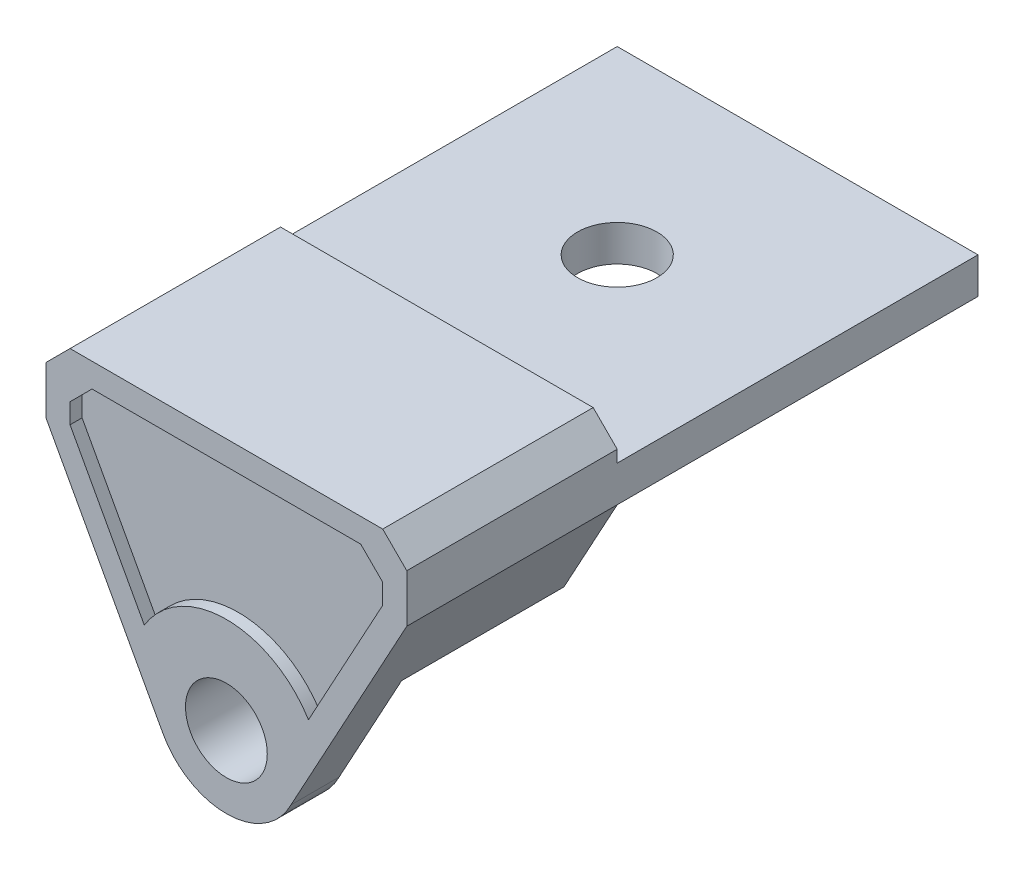
ISO-10303-21;
HEADER;
FILE_DESCRIPTION(('STEP AP214'),'2;1');
FILE_NAME('part.step','',(''),(''),'','','');
FILE_SCHEMA(('AUTOMOTIVE_DESIGN { 1 0 10303 214 1 1 1 1 }'));
ENDSEC;
DATA;
#1=APPLICATION_CONTEXT('core data for automotive mechanical design processes');
#2=APPLICATION_PROTOCOL_DEFINITION('international standard','automotive_design',2000,#1);
#3=PRODUCT_CONTEXT('',#1,'mechanical');
#4=PRODUCT('Part','Part','',(#3));
#5=PRODUCT_RELATED_PRODUCT_CATEGORY('part','',(#4));
#6=PRODUCT_DEFINITION_FORMATION('','',#4);
#7=PRODUCT_DEFINITION_CONTEXT('part definition',#1,'design');
#8=PRODUCT_DEFINITION('design','',#6,#7);
#9=PRODUCT_DEFINITION_SHAPE('','',#8);
#10=(LENGTH_UNIT() NAMED_UNIT(*) SI_UNIT(.MILLI.,.METRE.));
#11=(NAMED_UNIT(*) PLANE_ANGLE_UNIT() SI_UNIT($,.RADIAN.));
#12=(NAMED_UNIT(*) SI_UNIT($,.STERADIAN.) SOLID_ANGLE_UNIT());
#13=UNCERTAINTY_MEASURE_WITH_UNIT(LENGTH_MEASURE(1.E-05),#10,'distance_accuracy_value','');
#14=(GEOMETRIC_REPRESENTATION_CONTEXT(3) GLOBAL_UNCERTAINTY_ASSIGNED_CONTEXT((#13)) GLOBAL_UNIT_ASSIGNED_CONTEXT((#10,
#11,#12)) REPRESENTATION_CONTEXT('',''));
#15=CARTESIAN_POINT('',(0.,0.,0.));
#16=DIRECTION('',(0.,0.,1.));
#17=DIRECTION('',(1.,0.,0.));
#18=AXIS2_PLACEMENT_3D('',#15,#16,#17);
#19=CARTESIAN_POINT('',(0.,10.5,-14.4186473205535));
#20=DIRECTION('',(0.,-1.,0.));
#21=DIRECTION('',(1.,0.,0.));
#22=AXIS2_PLACEMENT_3D('',#19,#20,#21);
#23=PLANE('',#22);
#24=DIRECTION('',(-1.,0.,0.));
#25=VECTOR('',#24,1.);
#26=CARTESIAN_POINT('',(7.5,10.5,-2.));
#27=LINE('',#26,#25);
#28=CARTESIAN_POINT('',(6.50000000000001,10.5,-2.));
#29=VERTEX_POINT('',#28);
#30=CARTESIAN_POINT('',(-6.5,10.5,-2.));
#31=VERTEX_POINT('',#30);
#32=EDGE_CURVE('E295',#29,#31,#27,.T.);
#33=ORIENTED_EDGE('',*,*,#32,.T.);
#34=DIRECTION('',(0.,0.,1.));
#35=VECTOR('',#34,1.);
#36=CARTESIAN_POINT('',(-6.5,10.5,6.75));
#37=LINE('',#36,#35);
#38=CARTESIAN_POINT('',(-6.5,10.5,6.75));
#39=VERTEX_POINT('',#38);
#40=EDGE_CURVE('E280',#31,#39,#37,.T.);
#41=ORIENTED_EDGE('',*,*,#40,.T.);
#42=DIRECTION('',(1.,0.,0.));
#43=VECTOR('',#42,1.);
#44=CARTESIAN_POINT('',(0.,10.5,6.75));
#45=LINE('',#44,#43);
#46=CARTESIAN_POINT('',(6.50000000000001,10.5,6.75));
#47=VERTEX_POINT('',#46);
#48=EDGE_CURVE('E236',#39,#47,#45,.T.);
#49=ORIENTED_EDGE('',*,*,#48,.T.);
#50=DIRECTION('',(0.,0.,-1.));
#51=VECTOR('',#50,1.);
#52=CARTESIAN_POINT('',(6.50000000000001,10.5,-14.4186473205535));
#53=LINE('',#52,#51);
#54=EDGE_CURVE('E277',#47,#29,#53,.T.);
#55=ORIENTED_EDGE('',*,*,#54,.T.);
#56=EDGE_LOOP('',(#33,#41,#49,#55));
#57=FACE_BOUND('',#56,.T.);
#58=ADVANCED_FACE('F36',(#57),#23,.F.);
#59=CARTESIAN_POINT('',(0.,0.,6.75));
#60=DIRECTION('',(0.,0.,1.));
#61=DIRECTION('',(1.,0.,0.));
#62=AXIS2_PLACEMENT_3D('',#59,#60,#61);
#63=PLANE('',#62);
#64=ORIENTED_EDGE('',*,*,#48,.F.);
#65=DIRECTION('',(-0.707106781186549,-0.707106781186546,0.));
#66=VECTOR('',#65,1.);
#67=CARTESIAN_POINT('',(-8.49999999999998,8.50000000000002,6.75));
#68=LINE('',#67,#66);
#69=CARTESIAN_POINT('',(-7.5,9.5,6.75));
#70=VERTEX_POINT('',#69);
#71=EDGE_CURVE('E44',#39,#70,#68,.T.);
#72=ORIENTED_EDGE('',*,*,#71,.T.);
#73=DIRECTION('',(0.,-1.,0.));
#74=VECTOR('',#73,1.);
#75=CARTESIAN_POINT('',(-7.5,0.,6.75));
#76=LINE('',#75,#74);
#77=CARTESIAN_POINT('',(-7.5,7.5,6.75));
#78=VERTEX_POINT('',#77);
#79=EDGE_CURVE('E238',#70,#78,#76,.T.);
#80=ORIENTED_EDGE('',*,*,#79,.T.);
#81=DIRECTION('',(0.478232998312527,-0.878232998312527,0.));
#82=VECTOR('',#81,1.);
#83=CARTESIAN_POINT('',(-2.63469899493758,-1.43469899493758,6.75));
#84=LINE('',#83,#82);
#85=CARTESIAN_POINT('',(-2.63469899493758,-1.43469899493758,6.75));
#86=VERTEX_POINT('',#85);
#87=EDGE_CURVE('E240',#78,#86,#84,.T.);
#88=ORIENTED_EDGE('',*,*,#87,.T.);
#89=CARTESIAN_POINT('',(0.,0.,6.75));
#90=DIRECTION('',(0.,0.,1.));
#91=DIRECTION('',(1.,0.,0.));
#92=AXIS2_PLACEMENT_3D('',#89,#90,#91);
#93=CIRCLE('',#92,3.);
#94=CARTESIAN_POINT('',(2.68230667596494,-1.3435888121274,6.75));
#95=VERTEX_POINT('',#94);
#96=EDGE_CURVE('E259',#86,#95,#93,.T.);
#97=ORIENTED_EDGE('',*,*,#96,.T.);
#98=DIRECTION('',(-0.478386584531296,-0.87814934705919,0.));
#99=VECTOR('',#98,1.);
#100=CARTESIAN_POINT('',(2.63288556669336,-1.43430856941386,6.75));
#101=LINE('',#100,#99);
#102=CARTESIAN_POINT('',(7.5,7.5,6.75));
#103=VERTEX_POINT('',#102);
#104=EDGE_CURVE('E223',#103,#95,#101,.T.);
#105=ORIENTED_EDGE('',*,*,#104,.F.);
#106=DIRECTION('',(0.,-1.,0.));
#107=VECTOR('',#106,1.);
#108=CARTESIAN_POINT('',(7.5,0.,6.75));
#109=LINE('',#108,#107);
#110=CARTESIAN_POINT('',(7.5,9.5,6.75));
#111=VERTEX_POINT('',#110);
#112=EDGE_CURVE('E234',#111,#103,#109,.T.);
#113=ORIENTED_EDGE('',*,*,#112,.F.);
#114=DIRECTION('',(0.707106781186546,-0.707106781186549,0.));
#115=VECTOR('',#114,1.);
#116=CARTESIAN_POINT('',(8.50000000000002,8.49999999999999,6.75));
#117=LINE('',#116,#115);
#118=EDGE_CURVE('E56',#111,#47,#117,.F.);
#119=ORIENTED_EDGE('',*,*,#118,.T.);
#120=EDGE_LOOP('',(#64,#72,#80,#88,#97,#105,#113,#119));
#121=FACE_BOUND('',#120,.T.);
#122=CARTESIAN_POINT('',(0.,0.,6.75));
#123=DIRECTION('',(0.,0.,1.));
#124=DIRECTION('',(1.,0.,0.));
#125=AXIS2_PLACEMENT_3D('',#122,#123,#124);
#126=CIRCLE('',#125,1.7);
#127=CARTESIAN_POINT('',(1.7,0.,6.75));
#128=VERTEX_POINT('',#127);
#129=EDGE_CURVE('E262',#128,#128,#126,.T.);
#130=ORIENTED_EDGE('',*,*,#129,.F.);
#131=EDGE_LOOP('',(#130));
#132=FACE_BOUND('',#131,.T.);
#133=DIRECTION('',(0.478386584531296,0.87814934705919,0.));
#134=VECTOR('',#133,1.);
#135=CARTESIAN_POINT('',(1.75473621963417,-0.955921984882564,6.75));
#136=LINE('',#135,#134);
#137=CARTESIAN_POINT('',(3.41240709980625,2.08697814679309,6.75));
#138=VERTEX_POINT('',#137);
#139=CARTESIAN_POINT('',(6.5,7.75471168481908,6.75));
#140=VERTEX_POINT('',#139);
#141=EDGE_CURVE('E335',#138,#140,#136,.T.);
#142=ORIENTED_EDGE('',*,*,#141,.F.);
#143=CARTESIAN_POINT('',(0.,0.,6.75));
#144=DIRECTION('',(0.,0.,1.));
#145=DIRECTION('',(1.,0.,0.));
#146=AXIS2_PLACEMENT_3D('',#143,#144,#145);
#147=CIRCLE('',#146,4.);
#148=CARTESIAN_POINT('',(-3.41311369849165,2.08582235129665,6.75));
#149=VERTEX_POINT('',#148);
#150=EDGE_CURVE('E332',#138,#149,#147,.T.);
#151=ORIENTED_EDGE('',*,*,#150,.T.);
#152=DIRECTION('',(0.478232998312527,-0.878232998312527,0.));
#153=VECTOR('',#152,1.);
#154=CARTESIAN_POINT('',(-1.75646599662505,-0.956465996625053,6.75));
#155=LINE('',#154,#153);
#156=CARTESIAN_POINT('',(-6.5,7.7546185690179,6.75));
#157=VERTEX_POINT('',#156);
#158=EDGE_CURVE('E310',#157,#149,#155,.T.);
#159=ORIENTED_EDGE('',*,*,#158,.F.);
#160=DIRECTION('',(0.,-1.,0.));
#161=VECTOR('',#160,1.);
#162=CARTESIAN_POINT('',(-6.5,0.,6.75));
#163=LINE('',#162,#161);
#164=CARTESIAN_POINT('',(-6.5,8.58578643762691,6.75));
#165=VERTEX_POINT('',#164);
#166=EDGE_CURVE('E350',#165,#157,#163,.T.);
#167=ORIENTED_EDGE('',*,*,#166,.F.);
#168=DIRECTION('',(-0.707106781186549,-0.707106781186546,0.));
#169=VECTOR('',#168,1.);
#170=CARTESIAN_POINT('',(-7.54289321881344,7.54289321881348,6.75));
#171=LINE('',#170,#169);
#172=CARTESIAN_POINT('',(-5.58578643762691,9.5,6.75));
#173=VERTEX_POINT('',#172);
#174=EDGE_CURVE('E347',#173,#165,#171,.T.);
#175=ORIENTED_EDGE('',*,*,#174,.F.);
#176=DIRECTION('',(-1.,0.,0.));
#177=VECTOR('',#176,1.);
#178=CARTESIAN_POINT('',(0.,9.5,6.75));
#179=LINE('',#178,#177);
#180=CARTESIAN_POINT('',(5.5857864376269,9.5,6.75));
#181=VERTEX_POINT('',#180);
#182=EDGE_CURVE('E344',#181,#173,#179,.T.);
#183=ORIENTED_EDGE('',*,*,#182,.F.);
#184=DIRECTION('',(-0.70710678118655,0.707106781186546,0.));
#185=VECTOR('',#184,1.);
#186=CARTESIAN_POINT('',(7.54289321881344,7.54289321881348,6.75));
#187=LINE('',#186,#185);
#188=CARTESIAN_POINT('',(6.5,8.58578643762691,6.75));
#189=VERTEX_POINT('',#188);
#190=EDGE_CURVE('E341',#189,#181,#187,.T.);
#191=ORIENTED_EDGE('',*,*,#190,.F.);
#192=DIRECTION('',(0.,1.,0.));
#193=VECTOR('',#192,1.);
#194=CARTESIAN_POINT('',(6.49999999999999,0.,6.75));
#195=LINE('',#194,#193);
#196=EDGE_CURVE('E338',#140,#189,#195,.T.);
#197=ORIENTED_EDGE('',*,*,#196,.F.);
#198=EDGE_LOOP('',(#142,#151,#159,#167,#175,#183,#191,#197));
#199=FACE_BOUND('',#198,.T.);
#200=ADVANCED_FACE('F283',(#121,#132,#199),#63,.T.);
#201=CARTESIAN_POINT('',(0.,0.,4.75));
#202=DIRECTION('',(0.,0.,1.));
#203=DIRECTION('',(1.,0.,0.));
#204=AXIS2_PLACEMENT_3D('',#201,#202,#203);
#205=PLANE('',#204);
#206=CARTESIAN_POINT('',(0.,0.,4.75));
#207=DIRECTION('',(0.,0.,1.));
#208=DIRECTION('',(1.,0.,0.));
#209=AXIS2_PLACEMENT_3D('',#206,#207,#208);
#210=CIRCLE('',#209,2.7);
#211=CARTESIAN_POINT('',(2.7,0.,4.75));
#212=VERTEX_POINT('',#211);
#213=EDGE_CURVE('E268',#212,#212,#210,.T.);
#214=ORIENTED_EDGE('',*,*,#213,.T.);
#215=EDGE_LOOP('',(#214));
#216=FACE_BOUND('',#215,.T.);
#217=CARTESIAN_POINT('',(0.,0.,4.75));
#218=DIRECTION('',(0.,0.,1.));
#219=DIRECTION('',(1.,0.,0.));
#220=AXIS2_PLACEMENT_3D('',#217,#218,#219);
#221=CIRCLE('',#220,6.3);
#222=CARTESIAN_POINT('',(5.28353892833201,3.43135780600046,4.75));
#223=VERTEX_POINT('',#222);
#224=CARTESIAN_POINT('',(-5.28404074577219,3.43058499341136,4.75));
#225=VERTEX_POINT('',#224);
#226=EDGE_CURVE('E265',#223,#225,#221,.T.);
#227=ORIENTED_EDGE('',*,*,#226,.F.);
#228=DIRECTION('',(0.478386584531296,0.87814934705919,0.));
#229=VECTOR('',#228,1.);
#230=CARTESIAN_POINT('',(2.63288556669336,-1.43430856941386,4.75));
#231=LINE('',#230,#229);
#232=CARTESIAN_POINT('',(2.68230667596494,-1.3435888121274,4.75));
#233=VERTEX_POINT('',#232);
#234=EDGE_CURVE('E224',#233,#223,#231,.T.);
#235=ORIENTED_EDGE('',*,*,#234,.F.);
#236=CARTESIAN_POINT('',(0.,0.,4.75));
#237=DIRECTION('',(0.,0.,1.));
#238=DIRECTION('',(1.,0.,0.));
#239=AXIS2_PLACEMENT_3D('',#236,#237,#238);
#240=CIRCLE('',#239,3.);
#241=CARTESIAN_POINT('',(-2.63469899493758,-1.43469899493758,4.75));
#242=VERTEX_POINT('',#241);
#243=EDGE_CURVE('E258',#242,#233,#240,.T.);
#244=ORIENTED_EDGE('',*,*,#243,.F.);
#245=DIRECTION('',(-0.478232998312527,0.878232998312527,0.));
#246=VECTOR('',#245,1.);
#247=CARTESIAN_POINT('',(-2.63469899493758,-1.43469899493758,4.75));
#248=LINE('',#247,#246);
#249=EDGE_CURVE('E227',#242,#225,#248,.T.);
#250=ORIENTED_EDGE('',*,*,#249,.T.);
#251=EDGE_LOOP('',(#227,#235,#244,#250));
#252=FACE_BOUND('',#251,.T.);
#253=ADVANCED_FACE('F406',(#216,#252),#205,.F.);
#254=CARTESIAN_POINT('',(0.,0.,6.75));
#255=DIRECTION('',(0.,0.,-1.));
#256=DIRECTION('',(-1.,0.,0.));
#257=AXIS2_PLACEMENT_3D('',#254,#255,#256);
#258=CYLINDRICAL_SURFACE('',#257,3.);
#259=DIRECTION('',(0.,0.,1.));
#260=VECTOR('',#259,1.);
#261=CARTESIAN_POINT('',(2.68230667596494,-1.3435888121274,-14.4186473205535));
#262=LINE('',#261,#260);
#263=EDGE_CURVE('E243',#233,#95,#262,.T.);
#264=ORIENTED_EDGE('',*,*,#263,.T.);
#265=ORIENTED_EDGE('',*,*,#96,.F.);
#266=DIRECTION('',(0.,0.,1.));
#267=VECTOR('',#266,1.);
#268=CARTESIAN_POINT('',(-2.63469899493758,-1.43469899493758,-14.4186473205535));
#269=LINE('',#268,#267);
#270=EDGE_CURVE('E228',#242,#86,#269,.T.);
#271=ORIENTED_EDGE('',*,*,#270,.F.);
#272=ORIENTED_EDGE('',*,*,#243,.T.);
#273=EDGE_LOOP('',(#264,#265,#271,#272));
#274=FACE_BOUND('',#273,.T.);
#275=ADVANCED_FACE('F403',(#274),#258,.T.);
#276=CARTESIAN_POINT('',(0.,0.,-2.));
#277=DIRECTION('',(0.,0.,-1.));
#278=DIRECTION('',(-1.,0.,0.));
#279=AXIS2_PLACEMENT_3D('',#276,#277,#278);
#280=PLANE('',#279);
#281=DIRECTION('',(-0.478386584531296,-0.87814934705919,0.));
#282=VECTOR('',#281,1.);
#283=CARTESIAN_POINT('',(2.63288556669336,-1.43430856941386,-2.));
#284=LINE('',#283,#282);
#285=CARTESIAN_POINT('',(7.5,7.5,-2.));
#286=VERTEX_POINT('',#285);
#287=CARTESIAN_POINT('',(5.28353892833201,3.43135780600046,-2.));
#288=VERTEX_POINT('',#287);
#289=EDGE_CURVE('E221',#286,#288,#284,.T.);
#290=ORIENTED_EDGE('',*,*,#289,.T.);
#291=CARTESIAN_POINT('',(0.,0.,-2.));
#292=DIRECTION('',(0.,0.,-1.));
#293=DIRECTION('',(-1.,0.,0.));
#294=AXIS2_PLACEMENT_3D('',#291,#292,#293);
#295=CIRCLE('',#294,6.3);
#296=CARTESIAN_POINT('',(-5.28404074577219,3.43058499341136,-2.));
#297=VERTEX_POINT('',#296);
#298=EDGE_CURVE('E374',#297,#288,#295,.T.);
#299=ORIENTED_EDGE('',*,*,#298,.F.);
#300=DIRECTION('',(-0.478232998312527,0.878232998312527,0.));
#301=VECTOR('',#300,1.);
#302=CARTESIAN_POINT('',(-2.63469899493758,-1.43469899493758,-2.));
#303=LINE('',#302,#301);
#304=CARTESIAN_POINT('',(-7.5,7.5,-2.));
#305=VERTEX_POINT('',#304);
#306=EDGE_CURVE('E219',#297,#305,#303,.T.);
#307=ORIENTED_EDGE('',*,*,#306,.T.);
#308=DIRECTION('',(-1.,0.,0.));
#309=VECTOR('',#308,1.);
#310=CARTESIAN_POINT('',(7.5,7.5,-2.));
#311=LINE('',#310,#309);
#312=EDGE_CURVE('E213',#286,#305,#311,.T.);
#313=ORIENTED_EDGE('',*,*,#312,.F.);
#314=EDGE_LOOP('',(#290,#299,#307,#313));
#315=FACE_BOUND('',#314,.T.);
#316=ADVANCED_FACE('F395',(#315),#280,.T.);
#317=CARTESIAN_POINT('',(0.,0.,4.75));
#318=DIRECTION('',(0.,0.,-1.));
#319=DIRECTION('',(-1.,0.,0.));
#320=AXIS2_PLACEMENT_3D('',#317,#318,#319);
#321=CYLINDRICAL_SURFACE('',#320,6.3);
#322=DIRECTION('',(0.,0.,-1.));
#323=VECTOR('',#322,1.);
#324=CARTESIAN_POINT('',(5.28353892833201,3.43135780600046,16.903693697454));
#325=LINE('',#324,#323);
#326=EDGE_CURVE('E357',#223,#288,#325,.T.);
#327=ORIENTED_EDGE('',*,*,#326,.F.);
#328=ORIENTED_EDGE('',*,*,#226,.T.);
#329=DIRECTION('',(0.,0.,-1.));
#330=VECTOR('',#329,1.);
#331=CARTESIAN_POINT('',(-5.28404074577219,3.43058499341136,16.903693697454));
#332=LINE('',#331,#330);
#333=EDGE_CURVE('E377',#225,#297,#332,.T.);
#334=ORIENTED_EDGE('',*,*,#333,.T.);
#335=ORIENTED_EDGE('',*,*,#298,.T.);
#336=EDGE_LOOP('',(#327,#328,#334,#335));
#337=FACE_BOUND('',#336,.T.);
#338=ADVANCED_FACE('F408',(#337),#321,.F.);
#339=CARTESIAN_POINT('',(0.,0.,6.75));
#340=DIRECTION('',(0.,0.,-1.));
#341=DIRECTION('',(-1.,0.,0.));
#342=AXIS2_PLACEMENT_3D('',#339,#340,#341);
#343=CYLINDRICAL_SURFACE('',#342,1.7);
#344=ORIENTED_EDGE('',*,*,#129,.T.);
#345=EDGE_LOOP('',(#344));
#346=FACE_BOUND('',#345,.T.);
#347=CARTESIAN_POINT('',(0.,0.,4.25));
#348=DIRECTION('',(0.,0.,-1.));
#349=DIRECTION('',(-1.,0.,0.));
#350=AXIS2_PLACEMENT_3D('',#347,#348,#349);
#351=CIRCLE('',#350,1.7);
#352=CARTESIAN_POINT('',(-1.7,0.,4.25));
#353=VERTEX_POINT('',#352);
#354=EDGE_CURVE('E231',#353,#353,#351,.F.);
#355=ORIENTED_EDGE('',*,*,#354,.F.);
#356=EDGE_LOOP('',(#355));
#357=FACE_BOUND('',#356,.T.);
#358=ADVANCED_FACE('F410',(#346,#357),#343,.F.);
#359=CARTESIAN_POINT('',(0.,0.,4.25));
#360=DIRECTION('',(0.,0.,-1.));
#361=DIRECTION('',(-1.,0.,0.));
#362=AXIS2_PLACEMENT_3D('',#359,#360,#361);
#363=PLANE('',#362);
#364=ORIENTED_EDGE('',*,*,#354,.T.);
#365=EDGE_LOOP('',(#364));
#366=FACE_BOUND('',#365,.T.);
#367=CARTESIAN_POINT('',(0.,0.,4.25));
#368=DIRECTION('',(0.,0.,-1.));
#369=DIRECTION('',(-1.,0.,0.));
#370=AXIS2_PLACEMENT_3D('',#367,#368,#369);
#371=CIRCLE('',#370,2.2);
#372=CARTESIAN_POINT('',(-2.2,0.,4.25));
#373=VERTEX_POINT('',#372);
#374=EDGE_CURVE('E255',#373,#373,#371,.T.);
#375=ORIENTED_EDGE('',*,*,#374,.T.);
#376=EDGE_LOOP('',(#375));
#377=FACE_BOUND('',#376,.T.);
#378=ADVANCED_FACE('F416',(#366,#377),#363,.T.);
#379=CARTESIAN_POINT('',(0.,0.,4.25));
#380=DIRECTION('',(0.,0.,1.));
#381=DIRECTION('',(1.,0.,0.));
#382=AXIS2_PLACEMENT_3D('',#379,#380,#381);
#383=CONICAL_SURFACE('',#382,2.2,0.785398163397444);
#384=ORIENTED_EDGE('',*,*,#213,.F.);
#385=EDGE_LOOP('',(#384));
#386=FACE_BOUND('',#385,.T.);
#387=ORIENTED_EDGE('',*,*,#374,.F.);
#388=EDGE_LOOP('',(#387));
#389=FACE_BOUND('',#388,.T.);
#390=ADVANCED_FACE('F435',(#386,#389),#383,.T.);
#391=CARTESIAN_POINT('',(2.63288556669336,-1.43430856941386,-14.4186473205535));
#392=DIRECTION('',(-0.87814934705919,0.478386584531296,0.));
#393=DIRECTION('',(-0.478386584531296,-0.87814934705919,0.));
#394=AXIS2_PLACEMENT_3D('',#391,#392,#393);
#395=PLANE('',#394);
#396=ORIENTED_EDGE('',*,*,#234,.T.);
#397=ORIENTED_EDGE('',*,*,#326,.T.);
#398=ORIENTED_EDGE('',*,*,#289,.F.);
#399=DIRECTION('',(0.,0.,1.));
#400=VECTOR('',#399,1.);
#401=CARTESIAN_POINT('',(7.5,7.5,-14.4186473205535));
#402=LINE('',#401,#400);
#403=EDGE_CURVE('E249',#286,#103,#402,.T.);
#404=ORIENTED_EDGE('',*,*,#403,.T.);
#405=ORIENTED_EDGE('',*,*,#104,.T.);
#406=ORIENTED_EDGE('',*,*,#263,.F.);
#407=EDGE_LOOP('',(#396,#397,#398,#404,#405,#406));
#408=FACE_BOUND('',#407,.T.);
#409=ADVANCED_FACE('F391',(#408),#395,.F.);
#410=CARTESIAN_POINT('',(7.5,0.,-14.4186473205535));
#411=DIRECTION('',(-1.,0.,0.));
#412=DIRECTION('',(0.,-1.,0.));
#413=AXIS2_PLACEMENT_3D('',#410,#411,#412);
#414=PLANE('',#413);
#415=DIRECTION('',(0.,1.,0.));
#416=VECTOR('',#415,1.);
#417=CARTESIAN_POINT('',(7.5,10.5,-2.));
#418=LINE('',#417,#416);
#419=CARTESIAN_POINT('',(7.5,9.,-2.));
#420=VERTEX_POINT('',#419);
#421=CARTESIAN_POINT('',(7.5,9.5,-2.));
#422=VERTEX_POINT('',#421);
#423=EDGE_CURVE('E298',#420,#422,#418,.T.);
#424=ORIENTED_EDGE('',*,*,#423,.T.);
#425=DIRECTION('',(0.,0.,1.));
#426=VECTOR('',#425,1.);
#427=CARTESIAN_POINT('',(7.5,9.5,-14.4186473205535));
#428=LINE('',#427,#426);
#429=EDGE_CURVE('E11',#422,#111,#428,.T.);
#430=ORIENTED_EDGE('',*,*,#429,.T.);
#431=ORIENTED_EDGE('',*,*,#112,.T.);
#432=ORIENTED_EDGE('',*,*,#403,.F.);
#433=DIRECTION('',(0.,0.,1.));
#434=VECTOR('',#433,1.);
#435=CARTESIAN_POINT('',(7.5,7.5,-17.));
#436=LINE('',#435,#434);
#437=CARTESIAN_POINT('',(7.5,7.5,-17.));
#438=VERTEX_POINT('',#437);
#439=EDGE_CURVE('E207',#438,#286,#436,.T.);
#440=ORIENTED_EDGE('',*,*,#439,.F.);
#441=DIRECTION('',(0.,-1.,0.));
#442=VECTOR('',#441,1.);
#443=CARTESIAN_POINT('',(7.5,10.5,-17.));
#444=LINE('',#443,#442);
#445=CARTESIAN_POINT('',(7.5,9.,-17.));
#446=VERTEX_POINT('',#445);
#447=EDGE_CURVE('E209',#446,#438,#444,.T.);
#448=ORIENTED_EDGE('',*,*,#447,.F.);
#449=DIRECTION('',(0.,0.,-1.));
#450=VECTOR('',#449,1.);
#451=CARTESIAN_POINT('',(7.5,9.,13.0748134316813));
#452=LINE('',#451,#450);
#453=EDGE_CURVE('E186',#420,#446,#452,.T.);
#454=ORIENTED_EDGE('',*,*,#453,.F.);
#455=EDGE_LOOP('',(#424,#430,#431,#432,#440,#448,#454));
#456=FACE_BOUND('',#455,.T.);
#457=ADVANCED_FACE('F387',(#456),#414,.F.);
#458=CARTESIAN_POINT('',(-7.5,0.,-14.4186473205535));
#459=DIRECTION('',(-1.,0.,0.));
#460=DIRECTION('',(0.,-1.,0.));
#461=AXIS2_PLACEMENT_3D('',#458,#459,#460);
#462=PLANE('',#461);
#463=ORIENTED_EDGE('',*,*,#79,.F.);
#464=DIRECTION('',(0.,0.,-1.));
#465=VECTOR('',#464,1.);
#466=CARTESIAN_POINT('',(-7.5,9.5,-2.));
#467=LINE('',#466,#465);
#468=CARTESIAN_POINT('',(-7.5,9.5,-2.));
#469=VERTEX_POINT('',#468);
#470=EDGE_CURVE('E271',#70,#469,#467,.T.);
#471=ORIENTED_EDGE('',*,*,#470,.T.);
#472=DIRECTION('',(0.,-1.,0.));
#473=VECTOR('',#472,1.);
#474=CARTESIAN_POINT('',(-7.5,10.5,-2.));
#475=LINE('',#474,#473);
#476=CARTESIAN_POINT('',(-7.5,9.,-2.));
#477=VERTEX_POINT('',#476);
#478=EDGE_CURVE('E199',#469,#477,#475,.T.);
#479=ORIENTED_EDGE('',*,*,#478,.T.);
#480=DIRECTION('',(0.,0.,-1.));
#481=VECTOR('',#480,1.);
#482=CARTESIAN_POINT('',(-7.5,9.,13.0748134316813));
#483=LINE('',#482,#481);
#484=CARTESIAN_POINT('',(-7.5,9.,-17.));
#485=VERTEX_POINT('',#484);
#486=EDGE_CURVE('E183',#477,#485,#483,.T.);
#487=ORIENTED_EDGE('',*,*,#486,.T.);
#488=DIRECTION('',(0.,1.,0.));
#489=VECTOR('',#488,1.);
#490=CARTESIAN_POINT('',(-7.5,10.5,-17.));
#491=LINE('',#490,#489);
#492=CARTESIAN_POINT('',(-7.5,7.5,-17.));
#493=VERTEX_POINT('',#492);
#494=EDGE_CURVE('E196',#493,#485,#491,.T.);
#495=ORIENTED_EDGE('',*,*,#494,.F.);
#496=DIRECTION('',(0.,0.,1.));
#497=VECTOR('',#496,1.);
#498=CARTESIAN_POINT('',(-7.5,7.5,-17.));
#499=LINE('',#498,#497);
#500=EDGE_CURVE('E205',#493,#305,#499,.T.);
#501=ORIENTED_EDGE('',*,*,#500,.T.);
#502=DIRECTION('',(0.,0.,1.));
#503=VECTOR('',#502,1.);
#504=CARTESIAN_POINT('',(-7.5,7.5,-14.4186473205535));
#505=LINE('',#504,#503);
#506=EDGE_CURVE('E246',#305,#78,#505,.T.);
#507=ORIENTED_EDGE('',*,*,#506,.T.);
#508=EDGE_LOOP('',(#463,#471,#479,#487,#495,#501,#507));
#509=FACE_BOUND('',#508,.T.);
#510=ADVANCED_FACE('F194',(#509),#462,.T.);
#511=CARTESIAN_POINT('',(-2.63469899493758,-1.43469899493758,-14.4186473205535));
#512=DIRECTION('',(-0.878232998312527,-0.478232998312527,0.));
#513=DIRECTION('',(0.478232998312527,-0.878232998312527,0.));
#514=AXIS2_PLACEMENT_3D('',#511,#512,#513);
#515=PLANE('',#514);
#516=ORIENTED_EDGE('',*,*,#333,.F.);
#517=ORIENTED_EDGE('',*,*,#249,.F.);
#518=ORIENTED_EDGE('',*,*,#270,.T.);
#519=ORIENTED_EDGE('',*,*,#87,.F.);
#520=ORIENTED_EDGE('',*,*,#506,.F.);
#521=ORIENTED_EDGE('',*,*,#306,.F.);
#522=EDGE_LOOP('',(#516,#517,#518,#519,#520,#521));
#523=FACE_BOUND('',#522,.T.);
#524=ADVANCED_FACE('F398',(#523),#515,.T.);
#525=CARTESIAN_POINT('',(7.5,7.5,-17.));
#526=DIRECTION('',(0.,1.,0.));
#527=DIRECTION('',(0.,0.,1.));
#528=AXIS2_PLACEMENT_3D('',#525,#526,#527);
#529=PLANE('',#528);
#530=CARTESIAN_POINT('',(0.,7.5,-9.5));
#531=DIRECTION('',(0.,-1.,0.));
#532=DIRECTION('',(0.,0.,-1.));
#533=AXIS2_PLACEMENT_3D('',#530,#531,#532);
#534=CIRCLE('',#533,1.65);
#535=CARTESIAN_POINT('',(0.,7.5,-11.15));
#536=VERTEX_POINT('',#535);
#537=EDGE_CURVE('E215',#536,#536,#534,.T.);
#538=ORIENTED_EDGE('',*,*,#537,.F.);
#539=EDGE_LOOP('',(#538));
#540=FACE_BOUND('',#539,.T.);
#541=ORIENTED_EDGE('',*,*,#312,.T.);
#542=ORIENTED_EDGE('',*,*,#500,.F.);
#543=DIRECTION('',(-1.,0.,0.));
#544=VECTOR('',#543,1.);
#545=CARTESIAN_POINT('',(7.5,7.5,-17.));
#546=LINE('',#545,#544);
#547=EDGE_CURVE('E203',#438,#493,#546,.T.);
#548=ORIENTED_EDGE('',*,*,#547,.F.);
#549=ORIENTED_EDGE('',*,*,#439,.T.);
#550=EDGE_LOOP('',(#541,#542,#548,#549));
#551=FACE_BOUND('',#550,.T.);
#552=ADVANCED_FACE('F385',(#540,#551),#529,.F.);
#553=CARTESIAN_POINT('',(0.,0.,-17.));
#554=DIRECTION('',(0.,0.,-1.));
#555=DIRECTION('',(-1.,0.,0.));
#556=AXIS2_PLACEMENT_3D('',#553,#554,#555);
#557=PLANE('',#556);
#558=DIRECTION('',(-1.,0.,0.));
#559=VECTOR('',#558,1.);
#560=CARTESIAN_POINT('',(7.5,9.,-17.));
#561=LINE('',#560,#559);
#562=EDGE_CURVE('E179',#446,#485,#561,.T.);
#563=ORIENTED_EDGE('',*,*,#562,.F.);
#564=ORIENTED_EDGE('',*,*,#447,.T.);
#565=ORIENTED_EDGE('',*,*,#547,.T.);
#566=ORIENTED_EDGE('',*,*,#494,.T.);
#567=EDGE_LOOP('',(#563,#564,#565,#566));
#568=FACE_BOUND('',#567,.T.);
#569=ADVANCED_FACE('F201',(#568),#557,.T.);
#570=CARTESIAN_POINT('',(0.,10.5,-9.5));
#571=DIRECTION('',(0.,-1.,0.));
#572=DIRECTION('',(0.,0.,-1.));
#573=AXIS2_PLACEMENT_3D('',#570,#571,#572);
#574=CYLINDRICAL_SURFACE('',#573,1.65);
#575=CARTESIAN_POINT('',(0.,9.00000000000001,-9.5));
#576=DIRECTION('',(0.,-1.,0.));
#577=DIRECTION('',(1.,0.,0.));
#578=AXIS2_PLACEMENT_3D('',#575,#576,#577);
#579=CIRCLE('',#578,1.65);
#580=CARTESIAN_POINT('',(0.,9.00000000000001,-11.15));
#581=VERTEX_POINT('',#580);
#582=EDGE_CURVE('E306',#581,#581,#579,.F.);
#583=CARTESIAN_POINT('',(0.,9.00000000000001,-11.15));
#584=CARTESIAN_POINT('',(0.,8.98437500000001,-11.15));
#585=CARTESIAN_POINT('',(0.,8.96875000000001,-11.15));
#586=CARTESIAN_POINT('',(0.,8.93750000000001,-11.15));
#587=CARTESIAN_POINT('',(0.,8.92187500000001,-11.15));
#588=CARTESIAN_POINT('',(0.,8.890625,-11.15));
#589=CARTESIAN_POINT('',(0.,8.875,-11.15));
#590=CARTESIAN_POINT('',(0.,8.84375,-11.15));
#591=CARTESIAN_POINT('',(0.,8.828125,-11.15));
#592=CARTESIAN_POINT('',(0.,8.796875,-11.15));
#593=CARTESIAN_POINT('',(0.,8.78125,-11.15));
#594=CARTESIAN_POINT('',(0.,8.75,-11.15));
#595=CARTESIAN_POINT('',(0.,8.734375,-11.15));
#596=CARTESIAN_POINT('',(0.,8.703125,-11.15));
#597=CARTESIAN_POINT('',(0.,8.6875,-11.15));
#598=CARTESIAN_POINT('',(0.,8.65625,-11.15));
#599=CARTESIAN_POINT('',(0.,8.640625,-11.15));
#600=CARTESIAN_POINT('',(0.,8.609375,-11.15));
#601=CARTESIAN_POINT('',(0.,8.59375,-11.15));
#602=CARTESIAN_POINT('',(0.,8.5625,-11.15));
#603=CARTESIAN_POINT('',(0.,8.546875,-11.15));
#604=CARTESIAN_POINT('',(0.,8.515625,-11.15));
#605=CARTESIAN_POINT('',(0.,8.5,-11.15));
#606=CARTESIAN_POINT('',(0.,8.46875,-11.15));
#607=CARTESIAN_POINT('',(0.,8.453125,-11.15));
#608=CARTESIAN_POINT('',(0.,8.421875,-11.15));
#609=CARTESIAN_POINT('',(0.,8.40625,-11.15));
#610=CARTESIAN_POINT('',(0.,8.375,-11.15));
#611=CARTESIAN_POINT('',(0.,8.359375,-11.15));
#612=CARTESIAN_POINT('',(0.,8.328125,-11.15));
#613=CARTESIAN_POINT('',(0.,8.3125,-11.15));
#614=CARTESIAN_POINT('',(0.,8.28125,-11.15));
#615=CARTESIAN_POINT('',(0.,8.265625,-11.15));
#616=CARTESIAN_POINT('',(0.,8.234375,-11.15));
#617=CARTESIAN_POINT('',(0.,8.21875,-11.15));
#618=CARTESIAN_POINT('',(0.,8.1875,-11.15));
#619=CARTESIAN_POINT('',(0.,8.171875,-11.15));
#620=CARTESIAN_POINT('',(0.,8.140625,-11.15));
#621=CARTESIAN_POINT('',(0.,8.125,-11.15));
#622=CARTESIAN_POINT('',(0.,8.09375,-11.15));
#623=CARTESIAN_POINT('',(0.,8.078125,-11.15));
#624=CARTESIAN_POINT('',(0.,8.046875,-11.15));
#625=CARTESIAN_POINT('',(0.,8.03125,-11.15));
#626=CARTESIAN_POINT('',(0.,8.,-11.15));
#627=CARTESIAN_POINT('',(0.,7.984375,-11.15));
#628=CARTESIAN_POINT('',(0.,7.953125,-11.15));
#629=CARTESIAN_POINT('',(0.,7.9375,-11.15));
#630=CARTESIAN_POINT('',(0.,7.90625,-11.15));
#631=CARTESIAN_POINT('',(0.,7.890625,-11.15));
#632=CARTESIAN_POINT('',(0.,7.859375,-11.15));
#633=CARTESIAN_POINT('',(0.,7.84375,-11.15));
#634=CARTESIAN_POINT('',(0.,7.8125,-11.15));
#635=CARTESIAN_POINT('',(0.,7.796875,-11.15));
#636=CARTESIAN_POINT('',(0.,7.765625,-11.15));
#637=CARTESIAN_POINT('',(0.,7.75,-11.15));
#638=CARTESIAN_POINT('',(0.,7.71875,-11.15));
#639=CARTESIAN_POINT('',(0.,7.703125,-11.15));
#640=CARTESIAN_POINT('',(0.,7.671875,-11.15));
#641=CARTESIAN_POINT('',(0.,7.65625,-11.15));
#642=CARTESIAN_POINT('',(0.,7.625,-11.15));
#643=CARTESIAN_POINT('',(0.,7.609375,-11.15));
#644=CARTESIAN_POINT('',(0.,7.578125,-11.15));
#645=CARTESIAN_POINT('',(0.,7.5625,-11.15));
#646=CARTESIAN_POINT('',(0.,7.53125,-11.15));
#647=CARTESIAN_POINT('',(0.,7.515625,-11.15));
#648=CARTESIAN_POINT('',(0.,7.5,-11.15));
#649=B_SPLINE_CURVE_WITH_KNOTS('',3,(#583,#584,#585,#586,#587,#588,#589,#590,#591,#592,#593,
#594,#595,#596,#597,#598,#599,#600,#601,#602,#603,#604,#605,#606,#607,#608,#609,#610,#611,#612,
#613,#614,#615,#616,#617,#618,#619,#620,#621,#622,#623,#624,#625,#626,#627,#628,#629,#630,#631,
#632,#633,#634,#635,#636,#637,#638,#639,#640,#641,#642,#643,#644,#645,#646,#647,#648),
.UNSPECIFIED.,.F.,.F.,(4,2,2,2,2,2,2,2,2,2,2,2,2,2,2,2,2,2,2,2,2,2,2,2,2,2,2,2,2,2,2,2,4),(0.,
0.046875,0.0937500000000018,0.140625000000002,0.187500000000002,0.234375000000002,
0.281250000000002,0.328125000000002,0.375000000000002,0.421875000000002,0.468750000000002,
0.515625000000002,0.562500000000002,0.609375000000004,0.656250000000002,0.703125000000004,
0.750000000000004,0.796875000000004,0.843750000000004,0.890625000000004,0.937500000000004,
0.984375000000004,1.03125,1.078125,1.12500000000001,1.17187500000001,1.21875000000001,
1.26562500000001,1.31250000000001,1.35937500000001,1.40625000000001,1.45312500000001,
1.50000000000001),.UNSPECIFIED.);
#650=EDGE_CURVE('BSEAM488',#581,#536,#649,.T.);
#651=ORIENTED_EDGE('',*,*,#582,.T.);
#652=ORIENTED_EDGE('',*,*,#537,.T.);
#653=ORIENTED_EDGE('',*,*,#650,.T.);
#654=ORIENTED_EDGE('',*,*,#650,.F.);
#655=EDGE_LOOP('',(#651,#653,#652,#654));
#656=FACE_BOUND('',#655,.T.);
#657=ADVANCED_FACE('F488',(#656),#574,.F.);
#658=CARTESIAN_POINT('',(0.,0.,6.25));
#659=DIRECTION('',(0.,0.,1.));
#660=DIRECTION('',(1.,0.,0.));
#661=AXIS2_PLACEMENT_3D('',#658,#659,#660);
#662=CYLINDRICAL_SURFACE('',#661,4.);
#663=ORIENTED_EDGE('',*,*,#150,.F.);
#664=DIRECTION('',(0.,0.,1.));
#665=VECTOR('',#664,1.);
#666=CARTESIAN_POINT('',(3.41240709980625,2.08697814679309,6.25));
#667=LINE('',#666,#665);
#668=CARTESIAN_POINT('',(3.41240709980625,2.08697814679309,6.25));
#669=VERTEX_POINT('',#668);
#670=EDGE_CURVE('E331',#669,#138,#667,.T.);
#671=ORIENTED_EDGE('',*,*,#670,.F.);
#672=CARTESIAN_POINT('',(0.,0.,6.25));
#673=DIRECTION('',(0.,0.,1.));
#674=DIRECTION('',(1.,0.,0.));
#675=AXIS2_PLACEMENT_3D('',#672,#673,#674);
#676=CIRCLE('',#675,4.);
#677=CARTESIAN_POINT('',(-3.41311369849165,2.08582235129665,6.25));
#678=VERTEX_POINT('',#677);
#679=EDGE_CURVE('E307',#669,#678,#676,.T.);
#680=ORIENTED_EDGE('',*,*,#679,.T.);
#681=DIRECTION('',(0.,0.,1.));
#682=VECTOR('',#681,1.);
#683=CARTESIAN_POINT('',(-3.41311369849165,2.08582235129665,6.25));
#684=LINE('',#683,#682);
#685=EDGE_CURVE('E355',#678,#149,#684,.T.);
#686=ORIENTED_EDGE('',*,*,#685,.T.);
#687=EDGE_LOOP('',(#663,#671,#680,#686));
#688=FACE_BOUND('',#687,.T.);
#689=ADVANCED_FACE('F493',(#688),#662,.T.);
#690=CARTESIAN_POINT('',(-1.75646599662505,-0.956465996625053,6.25));
#691=DIRECTION('',(-0.878232998312527,-0.478232998312527,0.));
#692=DIRECTION('',(0.478232998312527,-0.878232998312527,0.));
#693=AXIS2_PLACEMENT_3D('',#690,#691,#692);
#694=PLANE('',#693);
#695=ORIENTED_EDGE('',*,*,#158,.T.);
#696=ORIENTED_EDGE('',*,*,#685,.F.);
#697=DIRECTION('',(0.478232998312527,-0.878232998312527,0.));
#698=VECTOR('',#697,1.);
#699=CARTESIAN_POINT('',(-1.75646599662505,-0.956465996625053,6.25));
#700=LINE('',#699,#698);
#701=CARTESIAN_POINT('',(-6.5,7.7546185690179,6.25));
#702=VERTEX_POINT('',#701);
#703=EDGE_CURVE('E328',#702,#678,#700,.T.);
#704=ORIENTED_EDGE('',*,*,#703,.F.);
#705=DIRECTION('',(0.,0.,1.));
#706=VECTOR('',#705,1.);
#707=CARTESIAN_POINT('',(-6.5,7.7546185690179,6.25));
#708=LINE('',#707,#706);
#709=EDGE_CURVE('E358',#702,#157,#708,.T.);
#710=ORIENTED_EDGE('',*,*,#709,.T.);
#711=EDGE_LOOP('',(#695,#696,#704,#710));
#712=FACE_BOUND('',#711,.T.);
#713=ADVANCED_FACE('F506',(#712),#694,.F.);
#714=CARTESIAN_POINT('',(-6.5,0.,6.25));
#715=DIRECTION('',(-1.,0.,0.));
#716=DIRECTION('',(0.,0.,1.));
#717=AXIS2_PLACEMENT_3D('',#714,#715,#716);
#718=PLANE('',#717);
#719=ORIENTED_EDGE('',*,*,#166,.T.);
#720=ORIENTED_EDGE('',*,*,#709,.F.);
#721=DIRECTION('',(0.,-1.,0.));
#722=VECTOR('',#721,1.);
#723=CARTESIAN_POINT('',(-6.5,0.,6.25));
#724=LINE('',#723,#722);
#725=CARTESIAN_POINT('',(-6.5,8.58578643762691,6.25));
#726=VERTEX_POINT('',#725);
#727=EDGE_CURVE('E325',#726,#702,#724,.T.);
#728=ORIENTED_EDGE('',*,*,#727,.F.);
#729=DIRECTION('',(0.,0.,1.));
#730=VECTOR('',#729,1.);
#731=CARTESIAN_POINT('',(-6.5,8.58578643762691,6.25));
#732=LINE('',#731,#730);
#733=EDGE_CURVE('E360',#726,#165,#732,.T.);
#734=ORIENTED_EDGE('',*,*,#733,.T.);
#735=EDGE_LOOP('',(#719,#720,#728,#734));
#736=FACE_BOUND('',#735,.T.);
#737=ADVANCED_FACE('F517',(#736),#718,.F.);
#738=CARTESIAN_POINT('',(-7.54289321881344,7.54289321881348,6.25));
#739=DIRECTION('',(-0.707106781186546,0.707106781186549,0.));
#740=DIRECTION('',(-0.707106781186549,-0.707106781186546,0.));
#741=AXIS2_PLACEMENT_3D('',#738,#739,#740);
#742=PLANE('',#741);
#743=ORIENTED_EDGE('',*,*,#174,.T.);
#744=ORIENTED_EDGE('',*,*,#733,.F.);
#745=DIRECTION('',(-0.707106781186549,-0.707106781186546,0.));
#746=VECTOR('',#745,1.);
#747=CARTESIAN_POINT('',(-7.54289321881344,7.54289321881348,6.25));
#748=LINE('',#747,#746);
#749=CARTESIAN_POINT('',(-5.58578643762691,9.5,6.25));
#750=VERTEX_POINT('',#749);
#751=EDGE_CURVE('E322',#750,#726,#748,.T.);
#752=ORIENTED_EDGE('',*,*,#751,.F.);
#753=DIRECTION('',(0.,0.,1.));
#754=VECTOR('',#753,1.);
#755=CARTESIAN_POINT('',(-5.58578643762691,9.5,6.25));
#756=LINE('',#755,#754);
#757=EDGE_CURVE('E362',#750,#173,#756,.T.);
#758=ORIENTED_EDGE('',*,*,#757,.T.);
#759=EDGE_LOOP('',(#743,#744,#752,#758));
#760=FACE_BOUND('',#759,.T.);
#761=ADVANCED_FACE('F527',(#760),#742,.F.);
#762=CARTESIAN_POINT('',(0.,9.5,6.25));
#763=DIRECTION('',(0.,1.,0.));
#764=DIRECTION('',(0.,0.,1.));
#765=AXIS2_PLACEMENT_3D('',#762,#763,#764);
#766=PLANE('',#765);
#767=ORIENTED_EDGE('',*,*,#182,.T.);
#768=ORIENTED_EDGE('',*,*,#757,.F.);
#769=DIRECTION('',(-1.,0.,0.));
#770=VECTOR('',#769,1.);
#771=CARTESIAN_POINT('',(0.,9.5,6.25));
#772=LINE('',#771,#770);
#773=CARTESIAN_POINT('',(5.5857864376269,9.5,6.25));
#774=VERTEX_POINT('',#773);
#775=EDGE_CURVE('E319',#774,#750,#772,.T.);
#776=ORIENTED_EDGE('',*,*,#775,.F.);
#777=DIRECTION('',(0.,0.,1.));
#778=VECTOR('',#777,1.);
#779=CARTESIAN_POINT('',(5.5857864376269,9.5,6.25));
#780=LINE('',#779,#778);
#781=EDGE_CURVE('E364',#774,#181,#780,.T.);
#782=ORIENTED_EDGE('',*,*,#781,.T.);
#783=EDGE_LOOP('',(#767,#768,#776,#782));
#784=FACE_BOUND('',#783,.T.);
#785=ADVANCED_FACE('F537',(#784),#766,.F.);
#786=CARTESIAN_POINT('',(7.54289321881344,7.54289321881348,6.25));
#787=DIRECTION('',(0.707106781186546,0.70710678118655,0.));
#788=DIRECTION('',(-0.70710678118655,0.707106781186546,0.));
#789=AXIS2_PLACEMENT_3D('',#786,#787,#788);
#790=PLANE('',#789);
#791=ORIENTED_EDGE('',*,*,#190,.T.);
#792=ORIENTED_EDGE('',*,*,#781,.F.);
#793=DIRECTION('',(-0.70710678118655,0.707106781186546,0.));
#794=VECTOR('',#793,1.);
#795=CARTESIAN_POINT('',(7.54289321881344,7.54289321881348,6.25));
#796=LINE('',#795,#794);
#797=CARTESIAN_POINT('',(6.5,8.58578643762691,6.25));
#798=VERTEX_POINT('',#797);
#799=EDGE_CURVE('E316',#798,#774,#796,.T.);
#800=ORIENTED_EDGE('',*,*,#799,.F.);
#801=DIRECTION('',(0.,0.,1.));
#802=VECTOR('',#801,1.);
#803=CARTESIAN_POINT('',(6.5,8.58578643762691,6.25));
#804=LINE('',#803,#802);
#805=EDGE_CURVE('E366',#798,#189,#804,.T.);
#806=ORIENTED_EDGE('',*,*,#805,.T.);
#807=EDGE_LOOP('',(#791,#792,#800,#806));
#808=FACE_BOUND('',#807,.T.);
#809=ADVANCED_FACE('F547',(#808),#790,.F.);
#810=CARTESIAN_POINT('',(6.49999999999999,0.,6.25));
#811=DIRECTION('',(1.,0.,0.));
#812=DIRECTION('',(0.,1.,0.));
#813=AXIS2_PLACEMENT_3D('',#810,#811,#812);
#814=PLANE('',#813);
#815=ORIENTED_EDGE('',*,*,#196,.T.);
#816=ORIENTED_EDGE('',*,*,#805,.F.);
#817=DIRECTION('',(0.,1.,0.));
#818=VECTOR('',#817,1.);
#819=CARTESIAN_POINT('',(6.49999999999999,0.,6.25));
#820=LINE('',#819,#818);
#821=CARTESIAN_POINT('',(6.5,7.75471168481908,6.25));
#822=VERTEX_POINT('',#821);
#823=EDGE_CURVE('E313',#822,#798,#820,.T.);
#824=ORIENTED_EDGE('',*,*,#823,.F.);
#825=DIRECTION('',(0.,0.,1.));
#826=VECTOR('',#825,1.);
#827=CARTESIAN_POINT('',(6.5,7.75471168481908,6.25));
#828=LINE('',#827,#826);
#829=EDGE_CURVE('E368',#822,#140,#828,.T.);
#830=ORIENTED_EDGE('',*,*,#829,.T.);
#831=EDGE_LOOP('',(#815,#816,#824,#830));
#832=FACE_BOUND('',#831,.T.);
#833=ADVANCED_FACE('F557',(#832),#814,.F.);
#834=CARTESIAN_POINT('',(1.75473621963417,-0.955921984882564,6.25));
#835=DIRECTION('',(0.87814934705919,-0.478386584531296,0.));
#836=DIRECTION('',(0.478386584531296,0.87814934705919,0.));
#837=AXIS2_PLACEMENT_3D('',#834,#835,#836);
#838=PLANE('',#837);
#839=ORIENTED_EDGE('',*,*,#141,.T.);
#840=ORIENTED_EDGE('',*,*,#829,.F.);
#841=DIRECTION('',(0.478386584531296,0.87814934705919,0.));
#842=VECTOR('',#841,1.);
#843=CARTESIAN_POINT('',(1.75473621963417,-0.955921984882564,6.25));
#844=LINE('',#843,#842);
#845=EDGE_CURVE('E309',#669,#822,#844,.T.);
#846=ORIENTED_EDGE('',*,*,#845,.F.);
#847=ORIENTED_EDGE('',*,*,#670,.T.);
#848=EDGE_LOOP('',(#839,#840,#846,#847));
#849=FACE_BOUND('',#848,.T.);
#850=ADVANCED_FACE('F567',(#849),#838,.F.);
#851=CARTESIAN_POINT('',(0.,0.,6.25));
#852=DIRECTION('',(0.,0.,1.));
#853=DIRECTION('',(1.,0.,0.));
#854=AXIS2_PLACEMENT_3D('',#851,#852,#853);
#855=PLANE('',#854);
#856=ORIENTED_EDGE('',*,*,#679,.F.);
#857=ORIENTED_EDGE('',*,*,#845,.T.);
#858=ORIENTED_EDGE('',*,*,#823,.T.);
#859=ORIENTED_EDGE('',*,*,#799,.T.);
#860=ORIENTED_EDGE('',*,*,#775,.T.);
#861=ORIENTED_EDGE('',*,*,#751,.T.);
#862=ORIENTED_EDGE('',*,*,#727,.T.);
#863=ORIENTED_EDGE('',*,*,#703,.T.);
#864=EDGE_LOOP('',(#856,#857,#858,#859,#860,#861,#862,#863));
#865=FACE_BOUND('',#864,.T.);
#866=ADVANCED_FACE('F577',(#865),#855,.T.);
#867=CARTESIAN_POINT('',(7.5,9.,13.0748134316813));
#868=DIRECTION('',(0.,-1.,0.));
#869=DIRECTION('',(0.,0.,-1.));
#870=AXIS2_PLACEMENT_3D('',#867,#868,#869);
#871=PLANE('',#870);
#872=DIRECTION('',(1.,0.,0.));
#873=VECTOR('',#872,1.);
#874=CARTESIAN_POINT('',(7.5,9.,-2.));
#875=LINE('',#874,#873);
#876=EDGE_CURVE('E300',#477,#420,#875,.T.);
#877=ORIENTED_EDGE('',*,*,#876,.T.);
#878=ORIENTED_EDGE('',*,*,#453,.T.);
#879=ORIENTED_EDGE('',*,*,#562,.T.);
#880=ORIENTED_EDGE('',*,*,#486,.F.);
#881=EDGE_LOOP('',(#877,#878,#879,#880));
#882=FACE_BOUND('',#881,.T.);
#883=ORIENTED_EDGE('',*,*,#582,.F.);
#884=EDGE_LOOP('',(#883));
#885=FACE_BOUND('',#884,.T.);
#886=ADVANCED_FACE('F181',(#882,#885),#871,.F.);
#887=CARTESIAN_POINT('',(0.,0.,-2.));
#888=DIRECTION('',(0.,0.,-1.));
#889=DIRECTION('',(-1.,0.,0.));
#890=AXIS2_PLACEMENT_3D('',#887,#888,#889);
#891=PLANE('',#890);
#892=ORIENTED_EDGE('',*,*,#478,.F.);
#893=DIRECTION('',(0.707106781186549,0.707106781186546,0.));
#894=VECTOR('',#893,1.);
#895=CARTESIAN_POINT('',(-8.49999999999998,8.50000000000002,-2.));
#896=LINE('',#895,#894);
#897=EDGE_CURVE('E275',#469,#31,#896,.T.);
#898=ORIENTED_EDGE('',*,*,#897,.T.);
#899=ORIENTED_EDGE('',*,*,#32,.F.);
#900=DIRECTION('',(-0.707106781186546,0.707106781186549,0.));
#901=VECTOR('',#900,1.);
#902=CARTESIAN_POINT('',(8.50000000000002,8.49999999999999,-2.));
#903=LINE('',#902,#901);
#904=EDGE_CURVE('E273',#29,#422,#903,.F.);
#905=ORIENTED_EDGE('',*,*,#904,.T.);
#906=ORIENTED_EDGE('',*,*,#423,.F.);
#907=ORIENTED_EDGE('',*,*,#876,.F.);
#908=EDGE_LOOP('',(#892,#898,#899,#905,#906,#907));
#909=FACE_BOUND('',#908,.T.);
#910=ADVANCED_FACE('F294',(#909),#891,.T.);
#911=CARTESIAN_POINT('',(-7.5,9.5,-14.4186473205535));
#912=DIRECTION('',(-0.707106781186546,0.707106781186549,0.));
#913=DIRECTION('',(0.,0.,1.));
#914=AXIS2_PLACEMENT_3D('',#911,#912,#913);
#915=PLANE('',#914);
#916=ORIENTED_EDGE('',*,*,#71,.F.);
#917=ORIENTED_EDGE('',*,*,#40,.F.);
#918=ORIENTED_EDGE('',*,*,#897,.F.);
#919=ORIENTED_EDGE('',*,*,#470,.F.);
#920=EDGE_LOOP('',(#916,#917,#918,#919));
#921=FACE_BOUND('',#920,.T.);
#922=ADVANCED_FACE('F290',(#921),#915,.T.);
#923=CARTESIAN_POINT('',(6.50000000000001,10.5,-14.4186473205535));
#924=DIRECTION('',(-0.707106781186549,-0.707106781186546,0.));
#925=DIRECTION('',(0.,0.,-1.));
#926=AXIS2_PLACEMENT_3D('',#923,#924,#925);
#927=PLANE('',#926);
#928=ORIENTED_EDGE('',*,*,#118,.F.);
#929=ORIENTED_EDGE('',*,*,#429,.F.);
#930=ORIENTED_EDGE('',*,*,#904,.F.);
#931=ORIENTED_EDGE('',*,*,#54,.F.);
#932=EDGE_LOOP('',(#928,#929,#930,#931));
#933=FACE_BOUND('',#932,.T.);
#934=ADVANCED_FACE('F38',(#933),#927,.F.);
#935=CLOSED_SHELL('',(#58,#200,#253,#275,#316,#338,#358,#378,#390,#409,#457,#510,#524,#552,#569,
#657,#689,#713,#737,#761,#785,#809,#833,#850,#866,#886,#910,#922,#934));
#936=MANIFOLD_SOLID_BREP('B2',#935);
#937=ADVANCED_BREP_SHAPE_REPRESENTATION('',(#18,#936),#14);
#938=SHAPE_DEFINITION_REPRESENTATION(#9,#937);
ENDSEC;
END-ISO-10303-21;
